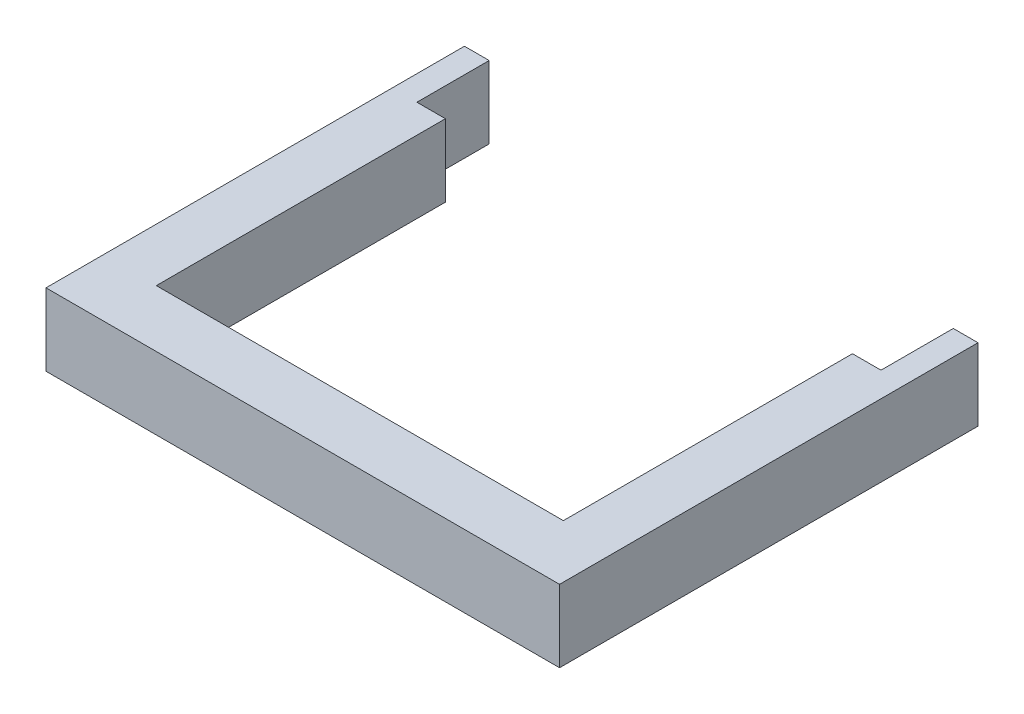
ISO-10303-21;
HEADER;
FILE_DESCRIPTION(('STEP AP214'),'2;1');
FILE_NAME('part.step','',(''),(''),'','','');
FILE_SCHEMA(('AUTOMOTIVE_DESIGN { 1 0 10303 214 1 1 1 1 }'));
ENDSEC;
DATA;
#1=APPLICATION_CONTEXT('core data for automotive mechanical design processes');
#2=APPLICATION_PROTOCOL_DEFINITION('international standard','automotive_design',2000,#1);
#3=PRODUCT_CONTEXT('',#1,'mechanical');
#4=PRODUCT('Part','Part','',(#3));
#5=PRODUCT_RELATED_PRODUCT_CATEGORY('part','',(#4));
#6=PRODUCT_DEFINITION_FORMATION('','',#4);
#7=PRODUCT_DEFINITION_CONTEXT('part definition',#1,'design');
#8=PRODUCT_DEFINITION('design','',#6,#7);
#9=PRODUCT_DEFINITION_SHAPE('','',#8);
#10=(LENGTH_UNIT() NAMED_UNIT(*) SI_UNIT(.MILLI.,.METRE.));
#11=(NAMED_UNIT(*) PLANE_ANGLE_UNIT() SI_UNIT($,.RADIAN.));
#12=(NAMED_UNIT(*) SI_UNIT($,.STERADIAN.) SOLID_ANGLE_UNIT());
#13=UNCERTAINTY_MEASURE_WITH_UNIT(LENGTH_MEASURE(1.E-05),#10,'distance_accuracy_value','');
#14=(GEOMETRIC_REPRESENTATION_CONTEXT(3) GLOBAL_UNCERTAINTY_ASSIGNED_CONTEXT((#13)) GLOBAL_UNIT_ASSIGNED_CONTEXT((#10,
#11,#12)) REPRESENTATION_CONTEXT('',''));
#15=CARTESIAN_POINT('',(0.,0.,0.));
#16=DIRECTION('',(0.,0.,1.));
#17=DIRECTION('',(1.,0.,0.));
#18=AXIS2_PLACEMENT_3D('',#15,#16,#17);
#19=CARTESIAN_POINT('',(13.5,3.8,0.));
#20=DIRECTION('',(-1.,0.,0.));
#21=DIRECTION('',(0.,0.,1.));
#22=AXIS2_PLACEMENT_3D('',#19,#20,#21);
#23=PLANE('',#22);
#24=DIRECTION('',(0.,0.,-1.));
#25=VECTOR('',#24,1.);
#26=CARTESIAN_POINT('',(13.5,0.,0.));
#27=LINE('',#26,#25);
#28=CARTESIAN_POINT('',(13.5,0.,0.));
#29=VERTEX_POINT('',#28);
#30=CARTESIAN_POINT('',(13.5,0.,-22.));
#31=VERTEX_POINT('',#30);
#32=EDGE_CURVE('E164',#29,#31,#27,.T.);
#33=ORIENTED_EDGE('',*,*,#32,.T.);
#34=DIRECTION('',(0.,-1.,0.));
#35=VECTOR('',#34,1.);
#36=CARTESIAN_POINT('',(13.5,3.8,-22.));
#37=LINE('',#36,#35);
#38=CARTESIAN_POINT('',(13.5,3.8,-22.));
#39=VERTEX_POINT('',#38);
#40=EDGE_CURVE('E11',#39,#31,#37,.T.);
#41=ORIENTED_EDGE('',*,*,#40,.F.);
#42=DIRECTION('',(0.,0.,-1.));
#43=VECTOR('',#42,1.);
#44=CARTESIAN_POINT('',(13.5,3.8,0.));
#45=LINE('',#44,#43);
#46=CARTESIAN_POINT('',(13.5,3.8,0.));
#47=VERTEX_POINT('',#46);
#48=EDGE_CURVE('E198',#47,#39,#45,.T.);
#49=ORIENTED_EDGE('',*,*,#48,.F.);
#50=DIRECTION('',(0.,-1.,0.));
#51=VECTOR('',#50,1.);
#52=CARTESIAN_POINT('',(13.5,3.8,0.));
#53=LINE('',#52,#51);
#54=EDGE_CURVE('E160',#47,#29,#53,.T.);
#55=ORIENTED_EDGE('',*,*,#54,.T.);
#56=EDGE_LOOP('',(#33,#41,#49,#55));
#57=FACE_BOUND('',#56,.T.);
#58=ADVANCED_FACE('F39',(#57),#23,.F.);
#59=CARTESIAN_POINT('',(13.5,3.8,-22.));
#60=DIRECTION('',(0.,0.,1.));
#61=DIRECTION('',(1.,0.,0.));
#62=AXIS2_PLACEMENT_3D('',#59,#60,#61);
#63=PLANE('',#62);
#64=DIRECTION('',(-1.,0.,0.));
#65=VECTOR('',#64,1.);
#66=CARTESIAN_POINT('',(13.5,0.,-22.));
#67=LINE('',#66,#65);
#68=CARTESIAN_POINT('',(12.2,0.,-22.));
#69=VERTEX_POINT('',#68);
#70=EDGE_CURVE('E168',#31,#69,#67,.T.);
#71=ORIENTED_EDGE('',*,*,#70,.T.);
#72=DIRECTION('',(0.,-1.,0.));
#73=VECTOR('',#72,1.);
#74=CARTESIAN_POINT('',(12.2,3.8,-22.));
#75=LINE('',#74,#73);
#76=CARTESIAN_POINT('',(12.2,3.8,-22.));
#77=VERTEX_POINT('',#76);
#78=EDGE_CURVE('E48',#77,#69,#75,.T.);
#79=ORIENTED_EDGE('',*,*,#78,.F.);
#80=DIRECTION('',(-1.,0.,0.));
#81=VECTOR('',#80,1.);
#82=CARTESIAN_POINT('',(13.5,3.8,-22.));
#83=LINE('',#82,#81);
#84=EDGE_CURVE('E111',#39,#77,#83,.T.);
#85=ORIENTED_EDGE('',*,*,#84,.F.);
#86=ORIENTED_EDGE('',*,*,#40,.T.);
#87=EDGE_LOOP('',(#71,#79,#85,#86));
#88=FACE_BOUND('',#87,.T.);
#89=ADVANCED_FACE('F292',(#88),#63,.F.);
#90=CARTESIAN_POINT('',(12.2,3.8,-22.));
#91=DIRECTION('',(1.,0.,0.));
#92=DIRECTION('',(0.,0.,-1.));
#93=AXIS2_PLACEMENT_3D('',#90,#91,#92);
#94=PLANE('',#93);
#95=DIRECTION('',(0.,0.,1.));
#96=VECTOR('',#95,1.);
#97=CARTESIAN_POINT('',(12.2,0.,-22.));
#98=LINE('',#97,#96);
#99=CARTESIAN_POINT('',(12.2,0.,-18.2));
#100=VERTEX_POINT('',#99);
#101=EDGE_CURVE('E171',#69,#100,#98,.T.);
#102=ORIENTED_EDGE('',*,*,#101,.T.);
#103=DIRECTION('',(0.,-1.,0.));
#104=VECTOR('',#103,1.);
#105=CARTESIAN_POINT('',(12.2,3.8,-18.2));
#106=LINE('',#105,#104);
#107=CARTESIAN_POINT('',(12.2,3.8,-18.2));
#108=VERTEX_POINT('',#107);
#109=EDGE_CURVE('E225',#108,#100,#106,.T.);
#110=ORIENTED_EDGE('',*,*,#109,.F.);
#111=DIRECTION('',(0.,0.,1.));
#112=VECTOR('',#111,1.);
#113=CARTESIAN_POINT('',(12.2,3.8,-22.));
#114=LINE('',#113,#112);
#115=EDGE_CURVE('E235',#77,#108,#114,.T.);
#116=ORIENTED_EDGE('',*,*,#115,.F.);
#117=ORIENTED_EDGE('',*,*,#78,.T.);
#118=EDGE_LOOP('',(#102,#110,#116,#117));
#119=FACE_BOUND('',#118,.T.);
#120=ADVANCED_FACE('F233',(#119),#94,.F.);
#121=CARTESIAN_POINT('',(12.2,3.8,-18.2));
#122=DIRECTION('',(0.,0.,1.));
#123=DIRECTION('',(1.,0.,0.));
#124=AXIS2_PLACEMENT_3D('',#121,#122,#123);
#125=PLANE('',#124);
#126=DIRECTION('',(-1.,0.,0.));
#127=VECTOR('',#126,1.);
#128=CARTESIAN_POINT('',(12.2,0.,-18.2));
#129=LINE('',#128,#127);
#130=CARTESIAN_POINT('',(10.7,0.,-18.2));
#131=VERTEX_POINT('',#130);
#132=EDGE_CURVE('E174',#100,#131,#129,.T.);
#133=ORIENTED_EDGE('',*,*,#132,.T.);
#134=DIRECTION('',(0.,-1.,0.));
#135=VECTOR('',#134,1.);
#136=CARTESIAN_POINT('',(10.7,3.8,-18.2));
#137=LINE('',#136,#135);
#138=CARTESIAN_POINT('',(10.7,3.8,-18.2));
#139=VERTEX_POINT('',#138);
#140=EDGE_CURVE('E221',#139,#131,#137,.T.);
#141=ORIENTED_EDGE('',*,*,#140,.F.);
#142=DIRECTION('',(-1.,0.,0.));
#143=VECTOR('',#142,1.);
#144=CARTESIAN_POINT('',(12.2,3.8,-18.2));
#145=LINE('',#144,#143);
#146=EDGE_CURVE('E254',#108,#139,#145,.T.);
#147=ORIENTED_EDGE('',*,*,#146,.F.);
#148=ORIENTED_EDGE('',*,*,#109,.T.);
#149=EDGE_LOOP('',(#133,#141,#147,#148));
#150=FACE_BOUND('',#149,.T.);
#151=ADVANCED_FACE('F244',(#150),#125,.F.);
#152=CARTESIAN_POINT('',(10.7,3.8,-18.2));
#153=DIRECTION('',(1.,0.,0.));
#154=DIRECTION('',(0.,0.,-1.));
#155=AXIS2_PLACEMENT_3D('',#152,#153,#154);
#156=PLANE('',#155);
#157=DIRECTION('',(0.,0.,1.));
#158=VECTOR('',#157,1.);
#159=CARTESIAN_POINT('',(10.7,0.,-18.2));
#160=LINE('',#159,#158);
#161=CARTESIAN_POINT('',(10.7,0.,-3.));
#162=VERTEX_POINT('',#161);
#163=EDGE_CURVE('E177',#131,#162,#160,.T.);
#164=ORIENTED_EDGE('',*,*,#163,.T.);
#165=DIRECTION('',(0.,-1.,0.));
#166=VECTOR('',#165,1.);
#167=CARTESIAN_POINT('',(10.7,3.8,-3.));
#168=LINE('',#167,#166);
#169=CARTESIAN_POINT('',(10.7,3.8,-3.));
#170=VERTEX_POINT('',#169);
#171=EDGE_CURVE('E217',#170,#162,#168,.T.);
#172=ORIENTED_EDGE('',*,*,#171,.F.);
#173=DIRECTION('',(0.,0.,1.));
#174=VECTOR('',#173,1.);
#175=CARTESIAN_POINT('',(10.7,3.8,-18.2));
#176=LINE('',#175,#174);
#177=EDGE_CURVE('E250',#139,#170,#176,.T.);
#178=ORIENTED_EDGE('',*,*,#177,.F.);
#179=ORIENTED_EDGE('',*,*,#140,.T.);
#180=EDGE_LOOP('',(#164,#172,#178,#179));
#181=FACE_BOUND('',#180,.T.);
#182=ADVANCED_FACE('F248',(#181),#156,.F.);
#183=CARTESIAN_POINT('',(10.7,3.8,-3.));
#184=DIRECTION('',(0.,0.,1.));
#185=DIRECTION('',(1.,0.,0.));
#186=AXIS2_PLACEMENT_3D('',#183,#184,#185);
#187=PLANE('',#186);
#188=DIRECTION('',(-1.,0.,0.));
#189=VECTOR('',#188,1.);
#190=CARTESIAN_POINT('',(10.7,0.,-3.));
#191=LINE('',#190,#189);
#192=CARTESIAN_POINT('',(-10.7,0.,-3.));
#193=VERTEX_POINT('',#192);
#194=EDGE_CURVE('E180',#162,#193,#191,.T.);
#195=ORIENTED_EDGE('',*,*,#194,.T.);
#196=DIRECTION('',(0.,-1.,0.));
#197=VECTOR('',#196,1.);
#198=CARTESIAN_POINT('',(-10.7,3.8,-3.));
#199=LINE('',#198,#197);
#200=CARTESIAN_POINT('',(-10.7,3.8,-3.));
#201=VERTEX_POINT('',#200);
#202=EDGE_CURVE('E213',#201,#193,#199,.T.);
#203=ORIENTED_EDGE('',*,*,#202,.F.);
#204=DIRECTION('',(-1.,0.,0.));
#205=VECTOR('',#204,1.);
#206=CARTESIAN_POINT('',(10.7,3.8,-3.));
#207=LINE('',#206,#205);
#208=EDGE_CURVE('E253',#170,#201,#207,.T.);
#209=ORIENTED_EDGE('',*,*,#208,.F.);
#210=ORIENTED_EDGE('',*,*,#171,.T.);
#211=EDGE_LOOP('',(#195,#203,#209,#210));
#212=FACE_BOUND('',#211,.T.);
#213=ADVANCED_FACE('F305',(#212),#187,.F.);
#214=CARTESIAN_POINT('',(-10.7,3.8,-18.2));
#215=DIRECTION('',(-1.,0.,0.));
#216=DIRECTION('',(0.,0.,1.));
#217=AXIS2_PLACEMENT_3D('',#214,#215,#216);
#218=PLANE('',#217);
#219=DIRECTION('',(0.,0.,-1.));
#220=VECTOR('',#219,1.);
#221=CARTESIAN_POINT('',(-10.7,0.,-18.2));
#222=LINE('',#221,#220);
#223=CARTESIAN_POINT('',(-10.7,0.,-18.2));
#224=VERTEX_POINT('',#223);
#225=EDGE_CURVE('E183',#193,#224,#222,.T.);
#226=ORIENTED_EDGE('',*,*,#225,.T.);
#227=DIRECTION('',(0.,-1.,0.));
#228=VECTOR('',#227,1.);
#229=CARTESIAN_POINT('',(-10.7,3.8,-18.2));
#230=LINE('',#229,#228);
#231=CARTESIAN_POINT('',(-10.7,3.8,-18.2));
#232=VERTEX_POINT('',#231);
#233=EDGE_CURVE('E209',#232,#224,#230,.T.);
#234=ORIENTED_EDGE('',*,*,#233,.F.);
#235=DIRECTION('',(0.,0.,-1.));
#236=VECTOR('',#235,1.);
#237=CARTESIAN_POINT('',(-10.7,3.8,-18.2));
#238=LINE('',#237,#236);
#239=EDGE_CURVE('E258',#201,#232,#238,.T.);
#240=ORIENTED_EDGE('',*,*,#239,.F.);
#241=ORIENTED_EDGE('',*,*,#202,.T.);
#242=EDGE_LOOP('',(#226,#234,#240,#241));
#243=FACE_BOUND('',#242,.T.);
#244=ADVANCED_FACE('F308',(#243),#218,.F.);
#245=CARTESIAN_POINT('',(-12.2,3.8,-18.2));
#246=DIRECTION('',(0.,0.,1.));
#247=DIRECTION('',(1.,0.,0.));
#248=AXIS2_PLACEMENT_3D('',#245,#246,#247);
#249=PLANE('',#248);
#250=DIRECTION('',(-1.,0.,0.));
#251=VECTOR('',#250,1.);
#252=CARTESIAN_POINT('',(-12.2,0.,-18.2));
#253=LINE('',#252,#251);
#254=CARTESIAN_POINT('',(-12.2,0.,-18.2));
#255=VERTEX_POINT('',#254);
#256=EDGE_CURVE('E186',#224,#255,#253,.T.);
#257=ORIENTED_EDGE('',*,*,#256,.T.);
#258=DIRECTION('',(0.,-1.,0.));
#259=VECTOR('',#258,1.);
#260=CARTESIAN_POINT('',(-12.2,3.8,-18.2));
#261=LINE('',#260,#259);
#262=CARTESIAN_POINT('',(-12.2,3.8,-18.2));
#263=VERTEX_POINT('',#262);
#264=EDGE_CURVE('E205',#263,#255,#261,.T.);
#265=ORIENTED_EDGE('',*,*,#264,.F.);
#266=DIRECTION('',(-1.,0.,0.));
#267=VECTOR('',#266,1.);
#268=CARTESIAN_POINT('',(-12.2,3.8,-18.2));
#269=LINE('',#268,#267);
#270=EDGE_CURVE('E265',#232,#263,#269,.T.);
#271=ORIENTED_EDGE('',*,*,#270,.F.);
#272=ORIENTED_EDGE('',*,*,#233,.T.);
#273=EDGE_LOOP('',(#257,#265,#271,#272));
#274=FACE_BOUND('',#273,.T.);
#275=ADVANCED_FACE('F273',(#274),#249,.F.);
#276=CARTESIAN_POINT('',(-12.2,3.8,-22.));
#277=DIRECTION('',(-1.,0.,0.));
#278=DIRECTION('',(0.,0.,1.));
#279=AXIS2_PLACEMENT_3D('',#276,#277,#278);
#280=PLANE('',#279);
#281=DIRECTION('',(0.,0.,-1.));
#282=VECTOR('',#281,1.);
#283=CARTESIAN_POINT('',(-12.2,0.,-22.));
#284=LINE('',#283,#282);
#285=CARTESIAN_POINT('',(-12.2,0.,-22.));
#286=VERTEX_POINT('',#285);
#287=EDGE_CURVE('E189',#255,#286,#284,.T.);
#288=ORIENTED_EDGE('',*,*,#287,.T.);
#289=DIRECTION('',(0.,-1.,0.));
#290=VECTOR('',#289,1.);
#291=CARTESIAN_POINT('',(-12.2,3.8,-22.));
#292=LINE('',#291,#290);
#293=CARTESIAN_POINT('',(-12.2,3.8,-22.));
#294=VERTEX_POINT('',#293);
#295=EDGE_CURVE('E153',#294,#286,#292,.T.);
#296=ORIENTED_EDGE('',*,*,#295,.F.);
#297=DIRECTION('',(0.,0.,-1.));
#298=VECTOR('',#297,1.);
#299=CARTESIAN_POINT('',(-12.2,3.8,-22.));
#300=LINE('',#299,#298);
#301=EDGE_CURVE('E142',#263,#294,#300,.T.);
#302=ORIENTED_EDGE('',*,*,#301,.F.);
#303=ORIENTED_EDGE('',*,*,#264,.T.);
#304=EDGE_LOOP('',(#288,#296,#302,#303));
#305=FACE_BOUND('',#304,.T.);
#306=ADVANCED_FACE('F277',(#305),#280,.F.);
#307=CARTESIAN_POINT('',(-13.5,3.8,-22.));
#308=DIRECTION('',(0.,0.,1.));
#309=DIRECTION('',(1.,0.,0.));
#310=AXIS2_PLACEMENT_3D('',#307,#308,#309);
#311=PLANE('',#310);
#312=DIRECTION('',(-1.,0.,0.));
#313=VECTOR('',#312,1.);
#314=CARTESIAN_POINT('',(-13.5,0.,-22.));
#315=LINE('',#314,#313);
#316=CARTESIAN_POINT('',(-13.5,0.,-22.));
#317=VERTEX_POINT('',#316);
#318=EDGE_CURVE('E151',#286,#317,#315,.T.);
#319=ORIENTED_EDGE('',*,*,#318,.T.);
#320=DIRECTION('',(0.,-1.,0.));
#321=VECTOR('',#320,1.);
#322=CARTESIAN_POINT('',(-13.5,3.8,-22.));
#323=LINE('',#322,#321);
#324=CARTESIAN_POINT('',(-13.5,3.8,-22.));
#325=VERTEX_POINT('',#324);
#326=EDGE_CURVE('E148',#325,#317,#323,.T.);
#327=ORIENTED_EDGE('',*,*,#326,.F.);
#328=DIRECTION('',(-1.,0.,0.));
#329=VECTOR('',#328,1.);
#330=CARTESIAN_POINT('',(-13.5,3.8,-22.));
#331=LINE('',#330,#329);
#332=EDGE_CURVE('E136',#294,#325,#331,.T.);
#333=ORIENTED_EDGE('',*,*,#332,.F.);
#334=ORIENTED_EDGE('',*,*,#295,.T.);
#335=EDGE_LOOP('',(#319,#327,#333,#334));
#336=FACE_BOUND('',#335,.T.);
#337=ADVANCED_FACE('F149',(#336),#311,.F.);
#338=CARTESIAN_POINT('',(-13.5,3.8,0.));
#339=DIRECTION('',(1.,0.,0.));
#340=DIRECTION('',(0.,0.,-1.));
#341=AXIS2_PLACEMENT_3D('',#338,#339,#340);
#342=PLANE('',#341);
#343=DIRECTION('',(0.,0.,1.));
#344=VECTOR('',#343,1.);
#345=CARTESIAN_POINT('',(-13.5,0.,0.));
#346=LINE('',#345,#344);
#347=CARTESIAN_POINT('',(-13.5,0.,0.));
#348=VERTEX_POINT('',#347);
#349=EDGE_CURVE('E97',#317,#348,#346,.T.);
#350=ORIENTED_EDGE('',*,*,#349,.T.);
#351=DIRECTION('',(0.,-1.,0.));
#352=VECTOR('',#351,1.);
#353=CARTESIAN_POINT('',(-13.5,3.8,0.));
#354=LINE('',#353,#352);
#355=CARTESIAN_POINT('',(-13.5,3.8,0.));
#356=VERTEX_POINT('',#355);
#357=EDGE_CURVE('E154',#356,#348,#354,.T.);
#358=ORIENTED_EDGE('',*,*,#357,.F.);
#359=DIRECTION('',(0.,0.,1.));
#360=VECTOR('',#359,1.);
#361=CARTESIAN_POINT('',(-13.5,3.8,0.));
#362=LINE('',#361,#360);
#363=EDGE_CURVE('E140',#325,#356,#362,.T.);
#364=ORIENTED_EDGE('',*,*,#363,.F.);
#365=ORIENTED_EDGE('',*,*,#326,.T.);
#366=EDGE_LOOP('',(#350,#358,#364,#365));
#367=FACE_BOUND('',#366,.T.);
#368=ADVANCED_FACE('F156',(#367),#342,.F.);
#369=CARTESIAN_POINT('',(-13.5,3.8,0.));
#370=DIRECTION('',(0.,0.,-1.));
#371=DIRECTION('',(-1.,0.,0.));
#372=AXIS2_PLACEMENT_3D('',#369,#370,#371);
#373=PLANE('',#372);
#374=DIRECTION('',(1.,0.,0.));
#375=VECTOR('',#374,1.);
#376=CARTESIAN_POINT('',(-13.5,0.,0.));
#377=LINE('',#376,#375);
#378=EDGE_CURVE('E103',#348,#29,#377,.T.);
#379=ORIENTED_EDGE('',*,*,#378,.T.);
#380=ORIENTED_EDGE('',*,*,#54,.F.);
#381=DIRECTION('',(1.,0.,0.));
#382=VECTOR('',#381,1.);
#383=CARTESIAN_POINT('',(-13.5,3.8,0.));
#384=LINE('',#383,#382);
#385=EDGE_CURVE('E56',#356,#47,#384,.T.);
#386=ORIENTED_EDGE('',*,*,#385,.F.);
#387=ORIENTED_EDGE('',*,*,#357,.T.);
#388=EDGE_LOOP('',(#379,#380,#386,#387));
#389=FACE_BOUND('',#388,.T.);
#390=ADVANCED_FACE('F281',(#389),#373,.F.);
#391=CARTESIAN_POINT('',(0.,3.8,0.));
#392=DIRECTION('',(0.,1.,0.));
#393=DIRECTION('',(0.,0.,1.));
#394=AXIS2_PLACEMENT_3D('',#391,#392,#393);
#395=PLANE('',#394);
#396=ORIENTED_EDGE('',*,*,#48,.T.);
#397=ORIENTED_EDGE('',*,*,#84,.T.);
#398=ORIENTED_EDGE('',*,*,#115,.T.);
#399=ORIENTED_EDGE('',*,*,#146,.T.);
#400=ORIENTED_EDGE('',*,*,#177,.T.);
#401=ORIENTED_EDGE('',*,*,#208,.T.);
#402=ORIENTED_EDGE('',*,*,#239,.T.);
#403=ORIENTED_EDGE('',*,*,#270,.T.);
#404=ORIENTED_EDGE('',*,*,#301,.T.);
#405=ORIENTED_EDGE('',*,*,#332,.T.);
#406=ORIENTED_EDGE('',*,*,#363,.T.);
#407=ORIENTED_EDGE('',*,*,#385,.T.);
#408=EDGE_LOOP('',(#396,#397,#398,#399,#400,#401,#402,#403,#404,#405,#406,#407));
#409=FACE_BOUND('',#408,.T.);
#410=ADVANCED_FACE('F138',(#409),#395,.T.);
#411=CARTESIAN_POINT('',(0.,0.,0.));
#412=DIRECTION('',(0.,1.,0.));
#413=DIRECTION('',(0.,0.,1.));
#414=AXIS2_PLACEMENT_3D('',#411,#412,#413);
#415=PLANE('',#414);
#416=ORIENTED_EDGE('',*,*,#32,.F.);
#417=ORIENTED_EDGE('',*,*,#378,.F.);
#418=ORIENTED_EDGE('',*,*,#349,.F.);
#419=ORIENTED_EDGE('',*,*,#318,.F.);
#420=ORIENTED_EDGE('',*,*,#287,.F.);
#421=ORIENTED_EDGE('',*,*,#256,.F.);
#422=ORIENTED_EDGE('',*,*,#225,.F.);
#423=ORIENTED_EDGE('',*,*,#194,.F.);
#424=ORIENTED_EDGE('',*,*,#163,.F.);
#425=ORIENTED_EDGE('',*,*,#132,.F.);
#426=ORIENTED_EDGE('',*,*,#101,.F.);
#427=ORIENTED_EDGE('',*,*,#70,.F.);
#428=EDGE_LOOP('',(#416,#417,#418,#419,#420,#421,#422,#423,#424,#425,#426,#427));
#429=FACE_BOUND('',#428,.T.);
#430=ADVANCED_FACE('F239',(#429),#415,.F.);
#431=CLOSED_SHELL('',(#58,#89,#120,#151,#182,#213,#244,#275,#306,#337,#368,#390,#410,#430));
#432=MANIFOLD_SOLID_BREP('B2',#431);
#433=ADVANCED_BREP_SHAPE_REPRESENTATION('',(#18,#432),#14);
#434=SHAPE_DEFINITION_REPRESENTATION(#9,#433);
ENDSEC;
END-ISO-10303-21;
